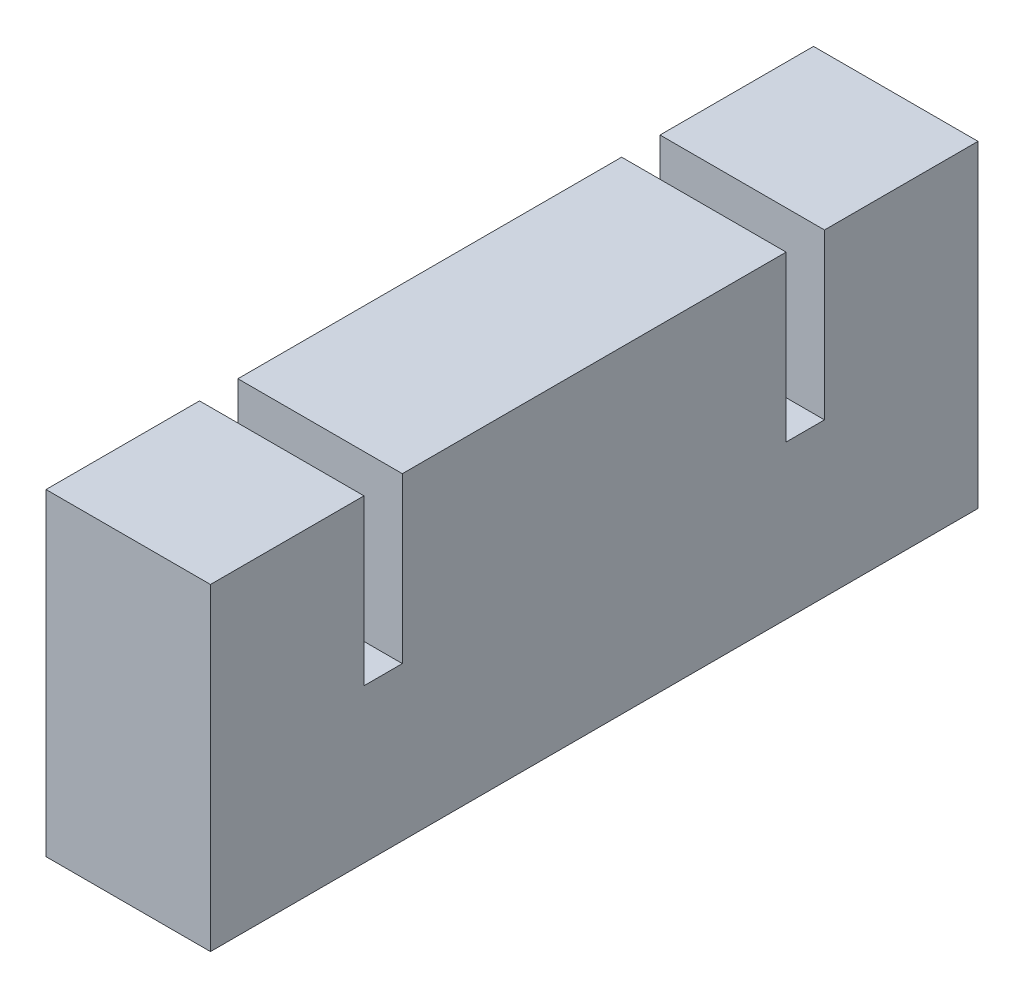
ISO-10303-21;
HEADER;
FILE_DESCRIPTION(('STEP AP214'),'2;1');
FILE_NAME('part.step','',(''),(''),'','','');
FILE_SCHEMA(('AUTOMOTIVE_DESIGN { 1 0 10303 214 1 1 1 1 }'));
ENDSEC;
DATA;
#1=APPLICATION_CONTEXT('core data for automotive mechanical design processes');
#2=APPLICATION_PROTOCOL_DEFINITION('international standard','automotive_design',2000,#1);
#3=PRODUCT_CONTEXT('',#1,'mechanical');
#4=PRODUCT('Part','Part','',(#3));
#5=PRODUCT_RELATED_PRODUCT_CATEGORY('part','',(#4));
#6=PRODUCT_DEFINITION_FORMATION('','',#4);
#7=PRODUCT_DEFINITION_CONTEXT('part definition',#1,'design');
#8=PRODUCT_DEFINITION('design','',#6,#7);
#9=PRODUCT_DEFINITION_SHAPE('','',#8);
#10=(LENGTH_UNIT() NAMED_UNIT(*) SI_UNIT(.MILLI.,.METRE.));
#11=(NAMED_UNIT(*) PLANE_ANGLE_UNIT() SI_UNIT($,.RADIAN.));
#12=(NAMED_UNIT(*) SI_UNIT($,.STERADIAN.) SOLID_ANGLE_UNIT());
#13=UNCERTAINTY_MEASURE_WITH_UNIT(LENGTH_MEASURE(1.E-05),#10,'distance_accuracy_value','');
#14=(GEOMETRIC_REPRESENTATION_CONTEXT(3) GLOBAL_UNCERTAINTY_ASSIGNED_CONTEXT((#13)) GLOBAL_UNIT_ASSIGNED_CONTEXT((#10,
#11,#12)) REPRESENTATION_CONTEXT('',''));
#15=CARTESIAN_POINT('',(0.,0.,0.));
#16=DIRECTION('',(0.,0.,1.));
#17=DIRECTION('',(1.,0.,0.));
#18=AXIS2_PLACEMENT_3D('',#15,#16,#17);
#19=CARTESIAN_POINT('',(0.,14.,0.));
#20=DIRECTION('',(0.,-1.,0.));
#21=DIRECTION('',(0.,0.,-1.));
#22=AXIS2_PLACEMENT_3D('',#19,#20,#21);
#23=PLANE('',#22);
#24=DIRECTION('',(1.,0.,0.));
#25=VECTOR('',#24,1.);
#26=CARTESIAN_POINT('',(0.,14.,-56.));
#27=LINE('',#26,#25);
#28=CARTESIAN_POINT('',(0.,14.,-56.));
#29=VERTEX_POINT('',#28);
#30=CARTESIAN_POINT('',(15.,14.,-56.));
#31=VERTEX_POINT('',#30);
#32=EDGE_CURVE('E50',#29,#31,#27,.T.);
#33=ORIENTED_EDGE('',*,*,#32,.F.);
#34=DIRECTION('',(0.,0.,1.));
#35=VECTOR('',#34,1.);
#36=CARTESIAN_POINT('',(0.,14.,0.));
#37=LINE('',#36,#35);
#38=CARTESIAN_POINT('',(0.,14.,-52.5));
#39=VERTEX_POINT('',#38);
#40=EDGE_CURVE('E36',#29,#39,#37,.T.);
#41=ORIENTED_EDGE('',*,*,#40,.T.);
#42=DIRECTION('',(-1.,0.,0.));
#43=VECTOR('',#42,1.);
#44=CARTESIAN_POINT('',(0.,14.,-52.5));
#45=LINE('',#44,#43);
#46=CARTESIAN_POINT('',(15.,14.,-52.5));
#47=VERTEX_POINT('',#46);
#48=EDGE_CURVE('E174',#47,#39,#45,.T.);
#49=ORIENTED_EDGE('',*,*,#48,.F.);
#50=DIRECTION('',(0.,0.,-1.));
#51=VECTOR('',#50,1.);
#52=CARTESIAN_POINT('',(15.,14.,0.));
#53=LINE('',#52,#51);
#54=EDGE_CURVE('E55',#47,#31,#53,.T.);
#55=ORIENTED_EDGE('',*,*,#54,.T.);
#56=EDGE_LOOP('',(#33,#41,#49,#55));
#57=FACE_BOUND('',#56,.T.);
#58=ADVANCED_FACE('F32',(#57),#23,.F.);
#59=DIRECTION('',(-1.,0.,0.));
#60=VECTOR('',#59,1.);
#61=CARTESIAN_POINT('',(15.,14.,-14.));
#62=LINE('',#61,#60);
#63=CARTESIAN_POINT('',(15.,14.,-14.));
#64=VERTEX_POINT('',#63);
#65=CARTESIAN_POINT('',(0.,14.,-14.));
#66=VERTEX_POINT('',#65);
#67=EDGE_CURVE('E145',#64,#66,#62,.T.);
#68=ORIENTED_EDGE('',*,*,#67,.F.);
#69=CARTESIAN_POINT('',(15.,14.,-17.5));
#70=VERTEX_POINT('',#69);
#71=EDGE_CURVE('E210',#64,#70,#53,.T.);
#72=ORIENTED_EDGE('',*,*,#71,.T.);
#73=DIRECTION('',(1.,0.,0.));
#74=VECTOR('',#73,1.);
#75=CARTESIAN_POINT('',(0.,14.,-17.5));
#76=LINE('',#75,#74);
#77=CARTESIAN_POINT('',(0.,14.,-17.5));
#78=VERTEX_POINT('',#77);
#79=EDGE_CURVE('E169',#78,#70,#76,.T.);
#80=ORIENTED_EDGE('',*,*,#79,.F.);
#81=EDGE_CURVE('E223',#78,#66,#37,.T.);
#82=ORIENTED_EDGE('',*,*,#81,.T.);
#83=EDGE_LOOP('',(#68,#72,#80,#82));
#84=FACE_BOUND('',#83,.T.);
#85=ADVANCED_FACE('F267',(#84),#23,.F.);
#86=CARTESIAN_POINT('',(0.,14.,0.));
#87=DIRECTION('',(1.,0.,0.));
#88=DIRECTION('',(0.,0.,-1.));
#89=AXIS2_PLACEMENT_3D('',#86,#87,#88);
#90=PLANE('',#89);
#91=DIRECTION('',(0.,0.,1.));
#92=VECTOR('',#91,1.);
#93=CARTESIAN_POINT('',(0.,0.,0.));
#94=LINE('',#93,#92);
#95=CARTESIAN_POINT('',(0.,0.,-70.));
#96=VERTEX_POINT('',#95);
#97=CARTESIAN_POINT('',(0.,0.,0.));
#98=VERTEX_POINT('',#97);
#99=EDGE_CURVE('E199',#96,#98,#94,.T.);
#100=ORIENTED_EDGE('',*,*,#99,.T.);
#101=DIRECTION('',(0.,-1.,0.));
#102=VECTOR('',#101,1.);
#103=CARTESIAN_POINT('',(0.,14.,0.));
#104=LINE('',#103,#102);
#105=CARTESIAN_POINT('',(0.,29.,0.));
#106=VERTEX_POINT('',#105);
#107=EDGE_CURVE('E11',#106,#98,#104,.T.);
#108=ORIENTED_EDGE('',*,*,#107,.F.);
#109=DIRECTION('',(0.,0.,1.));
#110=VECTOR('',#109,1.);
#111=CARTESIAN_POINT('',(0.,29.,-14.));
#112=LINE('',#111,#110);
#113=CARTESIAN_POINT('',(0.,29.,-14.));
#114=VERTEX_POINT('',#113);
#115=EDGE_CURVE('E157',#114,#106,#112,.T.);
#116=ORIENTED_EDGE('',*,*,#115,.F.);
#117=DIRECTION('',(0.,-1.,0.));
#118=VECTOR('',#117,1.);
#119=CARTESIAN_POINT('',(0.,29.,-14.));
#120=LINE('',#119,#118);
#121=EDGE_CURVE('E162',#114,#66,#120,.T.);
#122=ORIENTED_EDGE('',*,*,#121,.T.);
#123=ORIENTED_EDGE('',*,*,#81,.F.);
#124=DIRECTION('',(0.,-1.,0.));
#125=VECTOR('',#124,1.);
#126=CARTESIAN_POINT('',(0.,29.,-17.5));
#127=LINE('',#126,#125);
#128=CARTESIAN_POINT('',(0.,29.,-17.5));
#129=VERTEX_POINT('',#128);
#130=EDGE_CURVE('E193',#129,#78,#127,.T.);
#131=ORIENTED_EDGE('',*,*,#130,.F.);
#132=DIRECTION('',(0.,0.,1.));
#133=VECTOR('',#132,1.);
#134=CARTESIAN_POINT('',(0.,29.,-17.5));
#135=LINE('',#134,#133);
#136=CARTESIAN_POINT('',(0.,29.,-52.5));
#137=VERTEX_POINT('',#136);
#138=EDGE_CURVE('E170',#137,#129,#135,.T.);
#139=ORIENTED_EDGE('',*,*,#138,.F.);
#140=DIRECTION('',(0.,-1.,0.));
#141=VECTOR('',#140,1.);
#142=CARTESIAN_POINT('',(0.,29.,-52.5));
#143=LINE('',#142,#141);
#144=EDGE_CURVE('E180',#137,#39,#143,.T.);
#145=ORIENTED_EDGE('',*,*,#144,.T.);
#146=ORIENTED_EDGE('',*,*,#40,.F.);
#147=DIRECTION('',(0.,-1.,0.));
#148=VECTOR('',#147,1.);
#149=CARTESIAN_POINT('',(0.,29.,-56.));
#150=LINE('',#149,#148);
#151=CARTESIAN_POINT('',(0.,29.,-56.));
#152=VERTEX_POINT('',#151);
#153=EDGE_CURVE('E126',#152,#29,#150,.T.);
#154=ORIENTED_EDGE('',*,*,#153,.F.);
#155=DIRECTION('',(0.,0.,1.));
#156=VECTOR('',#155,1.);
#157=CARTESIAN_POINT('',(0.,29.,-56.));
#158=LINE('',#157,#156);
#159=CARTESIAN_POINT('',(0.,29.,-70.));
#160=VERTEX_POINT('',#159);
#161=EDGE_CURVE('E133',#160,#152,#158,.T.);
#162=ORIENTED_EDGE('',*,*,#161,.F.);
#163=DIRECTION('',(0.,-1.,0.));
#164=VECTOR('',#163,1.);
#165=CARTESIAN_POINT('',(0.,14.,-70.));
#166=LINE('',#165,#164);
#167=EDGE_CURVE('E211',#160,#96,#166,.T.);
#168=ORIENTED_EDGE('',*,*,#167,.T.);
#169=EDGE_LOOP('',(#100,#108,#116,#122,#123,#131,#139,#145,#146,#154,#162,#168));
#170=FACE_BOUND('',#169,.T.);
#171=ADVANCED_FACE('F34',(#170),#90,.F.);
#172=CARTESIAN_POINT('',(0.,14.,0.));
#173=DIRECTION('',(0.,0.,-1.));
#174=DIRECTION('',(-1.,0.,0.));
#175=AXIS2_PLACEMENT_3D('',#172,#173,#174);
#176=PLANE('',#175);
#177=DIRECTION('',(1.,0.,0.));
#178=VECTOR('',#177,1.);
#179=CARTESIAN_POINT('',(0.,0.,0.));
#180=LINE('',#179,#178);
#181=CARTESIAN_POINT('',(15.,0.,0.));
#182=VERTEX_POINT('',#181);
#183=EDGE_CURVE('E217',#98,#182,#180,.T.);
#184=ORIENTED_EDGE('',*,*,#183,.T.);
#185=DIRECTION('',(0.,-1.,0.));
#186=VECTOR('',#185,1.);
#187=CARTESIAN_POINT('',(15.,14.,0.));
#188=LINE('',#187,#186);
#189=CARTESIAN_POINT('',(15.,29.,0.));
#190=VERTEX_POINT('',#189);
#191=EDGE_CURVE('E42',#190,#182,#188,.T.);
#192=ORIENTED_EDGE('',*,*,#191,.F.);
#193=DIRECTION('',(1.,0.,0.));
#194=VECTOR('',#193,1.);
#195=CARTESIAN_POINT('',(15.,29.,0.));
#196=LINE('',#195,#194);
#197=EDGE_CURVE('E160',#106,#190,#196,.T.);
#198=ORIENTED_EDGE('',*,*,#197,.F.);
#199=ORIENTED_EDGE('',*,*,#107,.T.);
#200=EDGE_LOOP('',(#184,#192,#198,#199));
#201=FACE_BOUND('',#200,.T.);
#202=ADVANCED_FACE('F256',(#201),#176,.F.);
#203=CARTESIAN_POINT('',(15.,14.,0.));
#204=DIRECTION('',(-1.,0.,0.));
#205=DIRECTION('',(0.,0.,1.));
#206=AXIS2_PLACEMENT_3D('',#203,#204,#205);
#207=PLANE('',#206);
#208=DIRECTION('',(0.,0.,-1.));
#209=VECTOR('',#208,1.);
#210=CARTESIAN_POINT('',(15.,0.,0.));
#211=LINE('',#210,#209);
#212=CARTESIAN_POINT('',(15.,0.,-70.));
#213=VERTEX_POINT('',#212);
#214=EDGE_CURVE('E219',#182,#213,#211,.T.);
#215=ORIENTED_EDGE('',*,*,#214,.T.);
#216=DIRECTION('',(0.,-1.,0.));
#217=VECTOR('',#216,1.);
#218=CARTESIAN_POINT('',(15.,14.,-70.));
#219=LINE('',#218,#217);
#220=CARTESIAN_POINT('',(15.,29.,-70.));
#221=VERTEX_POINT('',#220);
#222=EDGE_CURVE('E225',#221,#213,#219,.T.);
#223=ORIENTED_EDGE('',*,*,#222,.F.);
#224=DIRECTION('',(0.,0.,-1.));
#225=VECTOR('',#224,1.);
#226=CARTESIAN_POINT('',(15.,29.,-56.));
#227=LINE('',#226,#225);
#228=CARTESIAN_POINT('',(15.,29.,-56.));
#229=VERTEX_POINT('',#228);
#230=EDGE_CURVE('E132',#229,#221,#227,.T.);
#231=ORIENTED_EDGE('',*,*,#230,.F.);
#232=DIRECTION('',(0.,-1.,0.));
#233=VECTOR('',#232,1.);
#234=CARTESIAN_POINT('',(15.,29.,-56.));
#235=LINE('',#234,#233);
#236=EDGE_CURVE('E128',#229,#31,#235,.T.);
#237=ORIENTED_EDGE('',*,*,#236,.T.);
#238=ORIENTED_EDGE('',*,*,#54,.F.);
#239=DIRECTION('',(0.,-1.,0.));
#240=VECTOR('',#239,1.);
#241=CARTESIAN_POINT('',(15.,29.,-52.5));
#242=LINE('',#241,#240);
#243=CARTESIAN_POINT('',(15.,29.,-52.5));
#244=VERTEX_POINT('',#243);
#245=EDGE_CURVE('E194',#244,#47,#242,.T.);
#246=ORIENTED_EDGE('',*,*,#245,.F.);
#247=DIRECTION('',(0.,0.,-1.));
#248=VECTOR('',#247,1.);
#249=CARTESIAN_POINT('',(15.,29.,-17.5));
#250=LINE('',#249,#248);
#251=CARTESIAN_POINT('',(15.,29.,-17.5));
#252=VERTEX_POINT('',#251);
#253=EDGE_CURVE('E176',#252,#244,#250,.T.);
#254=ORIENTED_EDGE('',*,*,#253,.F.);
#255=DIRECTION('',(0.,-1.,0.));
#256=VECTOR('',#255,1.);
#257=CARTESIAN_POINT('',(15.,29.,-17.5));
#258=LINE('',#257,#256);
#259=EDGE_CURVE('E190',#252,#70,#258,.T.);
#260=ORIENTED_EDGE('',*,*,#259,.T.);
#261=ORIENTED_EDGE('',*,*,#71,.F.);
#262=DIRECTION('',(0.,-1.,0.));
#263=VECTOR('',#262,1.);
#264=CARTESIAN_POINT('',(15.,29.,-14.));
#265=LINE('',#264,#263);
#266=CARTESIAN_POINT('',(15.,29.,-14.));
#267=VERTEX_POINT('',#266);
#268=EDGE_CURVE('E166',#267,#64,#265,.T.);
#269=ORIENTED_EDGE('',*,*,#268,.F.);
#270=DIRECTION('',(0.,0.,-1.));
#271=VECTOR('',#270,1.);
#272=CARTESIAN_POINT('',(15.,29.,-14.));
#273=LINE('',#272,#271);
#274=EDGE_CURVE('E148',#190,#267,#273,.T.);
#275=ORIENTED_EDGE('',*,*,#274,.F.);
#276=ORIENTED_EDGE('',*,*,#191,.T.);
#277=EDGE_LOOP('',(#215,#223,#231,#237,#238,#246,#254,#260,#261,#269,#275,#276));
#278=FACE_BOUND('',#277,.T.);
#279=ADVANCED_FACE('F244',(#278),#207,.F.);
#280=CARTESIAN_POINT('',(0.,14.,-70.));
#281=DIRECTION('',(0.,0.,1.));
#282=DIRECTION('',(1.,0.,0.));
#283=AXIS2_PLACEMENT_3D('',#280,#281,#282);
#284=PLANE('',#283);
#285=DIRECTION('',(-1.,0.,0.));
#286=VECTOR('',#285,1.);
#287=CARTESIAN_POINT('',(0.,0.,-70.));
#288=LINE('',#287,#286);
#289=EDGE_CURVE('E221',#213,#96,#288,.T.);
#290=ORIENTED_EDGE('',*,*,#289,.T.);
#291=ORIENTED_EDGE('',*,*,#167,.F.);
#292=DIRECTION('',(-1.,0.,0.));
#293=VECTOR('',#292,1.);
#294=CARTESIAN_POINT('',(0.,29.,-70.));
#295=LINE('',#294,#293);
#296=EDGE_CURVE('E139',#221,#160,#295,.T.);
#297=ORIENTED_EDGE('',*,*,#296,.F.);
#298=ORIENTED_EDGE('',*,*,#222,.T.);
#299=EDGE_LOOP('',(#290,#291,#297,#298));
#300=FACE_BOUND('',#299,.T.);
#301=ADVANCED_FACE('F248',(#300),#284,.F.);
#302=CARTESIAN_POINT('',(0.,0.,0.));
#303=DIRECTION('',(0.,-1.,0.));
#304=DIRECTION('',(0.,0.,-1.));
#305=AXIS2_PLACEMENT_3D('',#302,#303,#304);
#306=PLANE('',#305);
#307=ORIENTED_EDGE('',*,*,#99,.F.);
#308=ORIENTED_EDGE('',*,*,#289,.F.);
#309=ORIENTED_EDGE('',*,*,#214,.F.);
#310=ORIENTED_EDGE('',*,*,#183,.F.);
#311=EDGE_LOOP('',(#307,#308,#309,#310));
#312=FACE_BOUND('',#311,.T.);
#313=ADVANCED_FACE('F252',(#312),#306,.T.);
#314=CARTESIAN_POINT('',(0.,29.,-17.5));
#315=DIRECTION('',(0.,0.,-1.));
#316=DIRECTION('',(-1.,0.,0.));
#317=AXIS2_PLACEMENT_3D('',#314,#315,#316);
#318=PLANE('',#317);
#319=ORIENTED_EDGE('',*,*,#79,.T.);
#320=ORIENTED_EDGE('',*,*,#259,.F.);
#321=DIRECTION('',(1.,0.,0.));
#322=VECTOR('',#321,1.);
#323=CARTESIAN_POINT('',(0.,29.,-17.5));
#324=LINE('',#323,#322);
#325=EDGE_CURVE('E173',#129,#252,#324,.T.);
#326=ORIENTED_EDGE('',*,*,#325,.F.);
#327=ORIENTED_EDGE('',*,*,#130,.T.);
#328=EDGE_LOOP('',(#319,#320,#326,#327));
#329=FACE_BOUND('',#328,.T.);
#330=ADVANCED_FACE('F266',(#329),#318,.F.);
#331=CARTESIAN_POINT('',(0.,29.,-52.5));
#332=DIRECTION('',(0.,0.,1.));
#333=DIRECTION('',(1.,0.,0.));
#334=AXIS2_PLACEMENT_3D('',#331,#332,#333);
#335=PLANE('',#334);
#336=ORIENTED_EDGE('',*,*,#48,.T.);
#337=ORIENTED_EDGE('',*,*,#144,.F.);
#338=DIRECTION('',(-1.,0.,0.));
#339=VECTOR('',#338,1.);
#340=CARTESIAN_POINT('',(0.,29.,-52.5));
#341=LINE('',#340,#339);
#342=EDGE_CURVE('E178',#244,#137,#341,.T.);
#343=ORIENTED_EDGE('',*,*,#342,.F.);
#344=ORIENTED_EDGE('',*,*,#245,.T.);
#345=EDGE_LOOP('',(#336,#337,#343,#344));
#346=FACE_BOUND('',#345,.T.);
#347=ADVANCED_FACE('F234',(#346),#335,.F.);
#348=CARTESIAN_POINT('',(0.,29.,0.));
#349=DIRECTION('',(0.,-1.,0.));
#350=DIRECTION('',(0.,0.,-1.));
#351=AXIS2_PLACEMENT_3D('',#348,#349,#350);
#352=PLANE('',#351);
#353=ORIENTED_EDGE('',*,*,#138,.T.);
#354=ORIENTED_EDGE('',*,*,#325,.T.);
#355=ORIENTED_EDGE('',*,*,#253,.T.);
#356=ORIENTED_EDGE('',*,*,#342,.T.);
#357=EDGE_LOOP('',(#353,#354,#355,#356));
#358=FACE_BOUND('',#357,.T.);
#359=ADVANCED_FACE('F240',(#358),#352,.F.);
#360=CARTESIAN_POINT('',(15.,29.,-14.));
#361=DIRECTION('',(0.,0.,1.));
#362=DIRECTION('',(1.,0.,0.));
#363=AXIS2_PLACEMENT_3D('',#360,#361,#362);
#364=PLANE('',#363);
#365=ORIENTED_EDGE('',*,*,#67,.T.);
#366=ORIENTED_EDGE('',*,*,#121,.F.);
#367=DIRECTION('',(-1.,0.,0.));
#368=VECTOR('',#367,1.);
#369=CARTESIAN_POINT('',(15.,29.,-14.));
#370=LINE('',#369,#368);
#371=EDGE_CURVE('E155',#267,#114,#370,.T.);
#372=ORIENTED_EDGE('',*,*,#371,.F.);
#373=ORIENTED_EDGE('',*,*,#268,.T.);
#374=EDGE_LOOP('',(#365,#366,#372,#373));
#375=FACE_BOUND('',#374,.T.);
#376=ADVANCED_FACE('F264',(#375),#364,.F.);
#377=CARTESIAN_POINT('',(0.,29.,0.));
#378=DIRECTION('',(0.,-1.,0.));
#379=DIRECTION('',(0.,0.,-1.));
#380=AXIS2_PLACEMENT_3D('',#377,#378,#379);
#381=PLANE('',#380);
#382=ORIENTED_EDGE('',*,*,#274,.T.);
#383=ORIENTED_EDGE('',*,*,#371,.T.);
#384=ORIENTED_EDGE('',*,*,#115,.T.);
#385=ORIENTED_EDGE('',*,*,#197,.T.);
#386=EDGE_LOOP('',(#382,#383,#384,#385));
#387=FACE_BOUND('',#386,.T.);
#388=ADVANCED_FACE('F259',(#387),#381,.F.);
#389=CARTESIAN_POINT('',(0.,29.,-56.));
#390=DIRECTION('',(0.,0.,-1.));
#391=DIRECTION('',(-1.,0.,0.));
#392=AXIS2_PLACEMENT_3D('',#389,#390,#391);
#393=PLANE('',#392);
#394=ORIENTED_EDGE('',*,*,#32,.T.);
#395=ORIENTED_EDGE('',*,*,#236,.F.);
#396=DIRECTION('',(1.,0.,0.));
#397=VECTOR('',#396,1.);
#398=CARTESIAN_POINT('',(0.,29.,-56.));
#399=LINE('',#398,#397);
#400=EDGE_CURVE('E122',#152,#229,#399,.T.);
#401=ORIENTED_EDGE('',*,*,#400,.F.);
#402=ORIENTED_EDGE('',*,*,#153,.T.);
#403=EDGE_LOOP('',(#394,#395,#401,#402));
#404=FACE_BOUND('',#403,.T.);
#405=ADVANCED_FACE('F124',(#404),#393,.F.);
#406=CARTESIAN_POINT('',(0.,29.,0.));
#407=DIRECTION('',(0.,-1.,0.));
#408=DIRECTION('',(0.,0.,-1.));
#409=AXIS2_PLACEMENT_3D('',#406,#407,#408);
#410=PLANE('',#409);
#411=ORIENTED_EDGE('',*,*,#161,.T.);
#412=ORIENTED_EDGE('',*,*,#400,.T.);
#413=ORIENTED_EDGE('',*,*,#230,.T.);
#414=ORIENTED_EDGE('',*,*,#296,.T.);
#415=EDGE_LOOP('',(#411,#412,#413,#414));
#416=FACE_BOUND('',#415,.T.);
#417=ADVANCED_FACE('F137',(#416),#410,.F.);
#418=CLOSED_SHELL('',(#58,#85,#171,#202,#279,#301,#313,#330,#347,#359,#376,#388,#405,#417));
#419=MANIFOLD_SOLID_BREP('B2',#418);
#420=ADVANCED_BREP_SHAPE_REPRESENTATION('',(#18,#419),#14);
#421=SHAPE_DEFINITION_REPRESENTATION(#9,#420);
ENDSEC;
END-ISO-10303-21;
